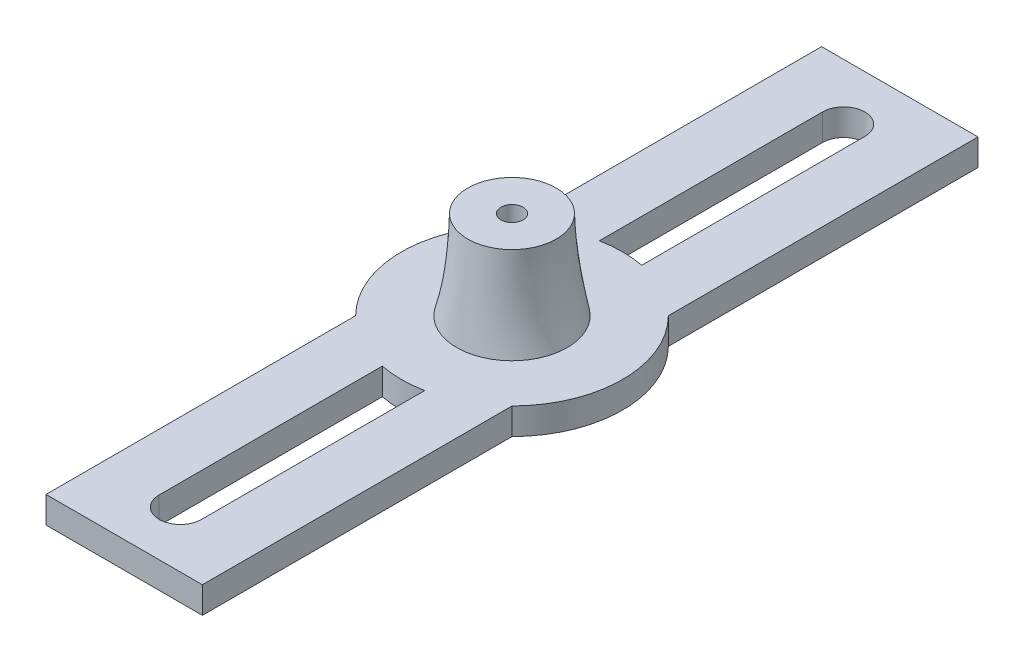
ISO-10303-21;
HEADER;
FILE_DESCRIPTION(('STEP AP214'),'2;1');
FILE_NAME('part.step','',(''),(''),'','','');
FILE_SCHEMA(('AUTOMOTIVE_DESIGN { 1 0 10303 214 1 1 1 1 }'));
ENDSEC;
DATA;
#1=APPLICATION_CONTEXT('core data for automotive mechanical design processes');
#2=APPLICATION_PROTOCOL_DEFINITION('international standard','automotive_design',2000,#1);
#3=PRODUCT_CONTEXT('',#1,'mechanical');
#4=PRODUCT('Part','Part','',(#3));
#5=PRODUCT_RELATED_PRODUCT_CATEGORY('part','',(#4));
#6=PRODUCT_DEFINITION_FORMATION('','',#4);
#7=PRODUCT_DEFINITION_CONTEXT('part definition',#1,'design');
#8=PRODUCT_DEFINITION('design','',#6,#7);
#9=PRODUCT_DEFINITION_SHAPE('','',#8);
#10=(LENGTH_UNIT() NAMED_UNIT(*) SI_UNIT(.MILLI.,.METRE.));
#11=(NAMED_UNIT(*) PLANE_ANGLE_UNIT() SI_UNIT($,.RADIAN.));
#12=(NAMED_UNIT(*) SI_UNIT($,.STERADIAN.) SOLID_ANGLE_UNIT());
#13=UNCERTAINTY_MEASURE_WITH_UNIT(LENGTH_MEASURE(1.E-05),#10,'distance_accuracy_value','');
#14=(GEOMETRIC_REPRESENTATION_CONTEXT(3) GLOBAL_UNCERTAINTY_ASSIGNED_CONTEXT((#13)) GLOBAL_UNIT_ASSIGNED_CONTEXT((#10,
#11,#12)) REPRESENTATION_CONTEXT('',''));
#15=CARTESIAN_POINT('',(0.,0.,0.));
#16=DIRECTION('',(0.,0.,1.));
#17=DIRECTION('',(1.,0.,0.));
#18=AXIS2_PLACEMENT_3D('',#15,#16,#17);
#19=CARTESIAN_POINT('',(0.,-3.,0.));
#20=DIRECTION('',(0.,1.,0.));
#21=DIRECTION('',(0.,0.,1.));
#22=AXIS2_PLACEMENT_3D('',#19,#20,#21);
#23=CYLINDRICAL_SURFACE('',#22,12.5);
#24=CARTESIAN_POINT('',(0.,0.,0.));
#25=DIRECTION('',(0.,1.,0.));
#26=DIRECTION('',(0.,0.,1.));
#27=AXIS2_PLACEMENT_3D('',#24,#25,#26);
#28=CIRCLE('',#27,12.5);
#29=CARTESIAN_POINT('',(2.39573347272426,0.,-12.2682705027102));
#30=VERTEX_POINT('',#29);
#31=CARTESIAN_POINT('',(-2.39573347272426,0.,-12.2682705027102));
#32=VERTEX_POINT('',#31);
#33=EDGE_CURVE('E393',#30,#32,#28,.T.);
#34=ORIENTED_EDGE('',*,*,#33,.F.);
#35=DIRECTION('',(0.,1.,0.));
#36=VECTOR('',#35,1.);
#37=CARTESIAN_POINT('',(2.39573347272426,-3.,-12.2682705027102));
#38=LINE('',#37,#36);
#39=CARTESIAN_POINT('',(2.39573347272426,-3.,-12.2682705027102));
#40=VERTEX_POINT('',#39);
#41=EDGE_CURVE('E270',#30,#40,#38,.F.);
#42=ORIENTED_EDGE('',*,*,#41,.T.);
#43=CARTESIAN_POINT('',(0.,-3.,0.));
#44=DIRECTION('',(0.,1.,0.));
#45=DIRECTION('',(0.,0.,1.));
#46=AXIS2_PLACEMENT_3D('',#43,#44,#45);
#47=CIRCLE('',#46,12.5);
#48=CARTESIAN_POINT('',(-2.39573347272426,-3.,-12.2682705027102));
#49=VERTEX_POINT('',#48);
#50=EDGE_CURVE('E114',#40,#49,#47,.T.);
#51=ORIENTED_EDGE('',*,*,#50,.T.);
#52=DIRECTION('',(0.,1.,0.));
#53=VECTOR('',#52,1.);
#54=CARTESIAN_POINT('',(-2.39573347272426,-3.,-12.2682705027102));
#55=LINE('',#54,#53);
#56=EDGE_CURVE('E261',#49,#32,#55,.T.);
#57=ORIENTED_EDGE('',*,*,#56,.T.);
#58=EDGE_LOOP('',(#34,#42,#51,#57));
#59=FACE_BOUND('',#58,.T.);
#60=ADVANCED_FACE('F103',(#59),#23,.T.);
#61=CARTESIAN_POINT('',(-2.39573347272426,-3.,12.2682705027102));
#62=VERTEX_POINT('',#61);
#63=CARTESIAN_POINT('',(2.39573347272426,-3.,12.2682705027102));
#64=VERTEX_POINT('',#63);
#65=EDGE_CURVE('E116',#62,#64,#47,.T.);
#66=ORIENTED_EDGE('',*,*,#65,.T.);
#67=DIRECTION('',(0.,1.,0.));
#68=VECTOR('',#67,1.);
#69=CARTESIAN_POINT('',(2.39573347272426,-3.,12.2682705027102));
#70=LINE('',#69,#68);
#71=CARTESIAN_POINT('',(2.39573347272426,0.,12.2682705027102));
#72=VERTEX_POINT('',#71);
#73=EDGE_CURVE('E267',#64,#72,#70,.T.);
#74=ORIENTED_EDGE('',*,*,#73,.T.);
#75=CARTESIAN_POINT('',(-2.39573347272426,0.,12.2682705027102));
#76=VERTEX_POINT('',#75);
#77=EDGE_CURVE('E350',#76,#72,#28,.T.);
#78=ORIENTED_EDGE('',*,*,#77,.F.);
#79=DIRECTION('',(0.,1.,0.));
#80=VECTOR('',#79,1.);
#81=CARTESIAN_POINT('',(-2.39573347272426,-3.,12.2682705027102));
#82=LINE('',#81,#80);
#83=EDGE_CURVE('E239',#76,#62,#82,.F.);
#84=ORIENTED_EDGE('',*,*,#83,.T.);
#85=EDGE_LOOP('',(#66,#74,#78,#84));
#86=FACE_BOUND('',#85,.T.);
#87=ADVANCED_FACE('F384',(#86),#23,.T.);
#88=DIRECTION('',(0.,1.,0.));
#89=VECTOR('',#88,1.);
#90=CARTESIAN_POINT('',(8.84061249383761,-3.,-8.83705667820471));
#91=LINE('',#90,#89);
#92=CARTESIAN_POINT('',(8.84061249383761,0.,-8.83705667820471));
#93=VERTEX_POINT('',#92);
#94=CARTESIAN_POINT('',(8.84061249383761,-3.,-8.83705667820471));
#95=VERTEX_POINT('',#94);
#96=EDGE_CURVE('E283',#93,#95,#91,.F.);
#97=ORIENTED_EDGE('',*,*,#96,.F.);
#98=CARTESIAN_POINT('',(8.84061249383761,0.,8.83705667820471));
#99=VERTEX_POINT('',#98);
#100=EDGE_CURVE('E356',#99,#93,#28,.T.);
#101=ORIENTED_EDGE('',*,*,#100,.F.);
#102=DIRECTION('',(0.,1.,0.));
#103=VECTOR('',#102,1.);
#104=CARTESIAN_POINT('',(8.84061249383761,-3.,8.83705667820471));
#105=LINE('',#104,#103);
#106=CARTESIAN_POINT('',(8.84061249383761,-3.,8.83705667820471));
#107=VERTEX_POINT('',#106);
#108=EDGE_CURVE('E280',#107,#99,#105,.T.);
#109=ORIENTED_EDGE('',*,*,#108,.F.);
#110=EDGE_CURVE('E13',#107,#95,#47,.T.);
#111=ORIENTED_EDGE('',*,*,#110,.T.);
#112=EDGE_LOOP('',(#97,#101,#109,#111));
#113=FACE_BOUND('',#112,.T.);
#114=ADVANCED_FACE('F370',(#113),#23,.T.);
#115=CARTESIAN_POINT('',(0.,0.,0.));
#116=DIRECTION('',(0.,1.,0.));
#117=DIRECTION('',(0.,0.,1.));
#118=AXIS2_PLACEMENT_3D('',#115,#116,#117);
#119=PLANE('',#118);
#120=CARTESIAN_POINT('',(-8.84061249383761,0.,-8.83705667820471));
#121=VERTEX_POINT('',#120);
#122=CARTESIAN_POINT('',(-8.84061249383761,0.,8.83705667820471));
#123=VERTEX_POINT('',#122);
#124=EDGE_CURVE('E359',#121,#123,#28,.T.);
#125=ORIENTED_EDGE('',*,*,#124,.T.);
#126=DIRECTION('',(0.,0.,-1.));
#127=VECTOR('',#126,1.);
#128=CARTESIAN_POINT('',(-8.84061249383761,0.,43.8412467482134));
#129=LINE('',#128,#127);
#130=CARTESIAN_POINT('',(-8.84061249383761,0.,43.8412467482134));
#131=VERTEX_POINT('',#130);
#132=EDGE_CURVE('E407',#131,#123,#129,.T.);
#133=ORIENTED_EDGE('',*,*,#132,.F.);
#134=DIRECTION('',(-1.,0.,0.));
#135=VECTOR('',#134,1.);
#136=CARTESIAN_POINT('',(-8.84061249383761,0.,43.8412467482134));
#137=LINE('',#136,#135);
#138=CARTESIAN_POINT('',(8.84061249383761,0.,43.8412467482134));
#139=VERTEX_POINT('',#138);
#140=EDGE_CURVE('E477',#139,#131,#137,.T.);
#141=ORIENTED_EDGE('',*,*,#140,.F.);
#142=DIRECTION('',(0.,0.,1.));
#143=VECTOR('',#142,1.);
#144=CARTESIAN_POINT('',(8.84061249383761,0.,43.8412467482134));
#145=LINE('',#144,#143);
#146=EDGE_CURVE('E429',#99,#139,#145,.T.);
#147=ORIENTED_EDGE('',*,*,#146,.F.);
#148=ORIENTED_EDGE('',*,*,#100,.T.);
#149=CARTESIAN_POINT('',(8.84061249383761,0.,-43.8412467482134));
#150=VERTEX_POINT('',#149);
#151=EDGE_CURVE('E475',#150,#93,#145,.T.);
#152=ORIENTED_EDGE('',*,*,#151,.F.);
#153=DIRECTION('',(1.,0.,0.));
#154=VECTOR('',#153,1.);
#155=CARTESIAN_POINT('',(-8.84061249383761,0.,-43.8412467482134));
#156=LINE('',#155,#154);
#157=CARTESIAN_POINT('',(-8.84061249383761,0.,-43.8412467482134));
#158=VERTEX_POINT('',#157);
#159=EDGE_CURVE('E445',#158,#150,#156,.T.);
#160=ORIENTED_EDGE('',*,*,#159,.F.);
#161=EDGE_CURVE('E410',#121,#158,#129,.T.);
#162=ORIENTED_EDGE('',*,*,#161,.F.);
#163=EDGE_LOOP('',(#125,#133,#141,#147,#148,#152,#160,#162));
#164=FACE_BOUND('',#163,.T.);
#165=CARTESIAN_POINT('',(0.,0.,0.));
#166=DIRECTION('',(0.,1.,0.));
#167=DIRECTION('',(0.,0.,1.));
#168=AXIS2_PLACEMENT_3D('',#165,#166,#167);
#169=CIRCLE('',#168,6.25);
#170=CARTESIAN_POINT('',(-6.25,0.,0.));
#171=VERTEX_POINT('',#170);
#172=EDGE_CURVE('E107',#171,#171,#169,.T.);
#173=ORIENTED_EDGE('',*,*,#172,.F.);
#174=EDGE_LOOP('',(#173));
#175=FACE_BOUND('',#174,.T.);
#176=DIRECTION('',(0.,0.,1.));
#177=VECTOR('',#176,1.);
#178=CARTESIAN_POINT('',(2.39573347272426,0.,37.5));
#179=LINE('',#178,#177);
#180=CARTESIAN_POINT('',(2.39573347272426,0.,-37.5));
#181=VERTEX_POINT('',#180);
#182=EDGE_CURVE('E233',#181,#30,#179,.T.);
#183=ORIENTED_EDGE('',*,*,#182,.T.);
#184=ORIENTED_EDGE('',*,*,#33,.T.);
#185=DIRECTION('',(0.,0.,-1.));
#186=VECTOR('',#185,1.);
#187=CARTESIAN_POINT('',(-2.39573347272426,0.,37.5));
#188=LINE('',#187,#186);
#189=CARTESIAN_POINT('',(-2.39573347272426,0.,-37.5));
#190=VERTEX_POINT('',#189);
#191=EDGE_CURVE('E123',#32,#190,#188,.T.);
#192=ORIENTED_EDGE('',*,*,#191,.T.);
#193=CARTESIAN_POINT('',(0.,0.,-37.5));
#194=DIRECTION('',(0.,-1.,0.));
#195=DIRECTION('',(0.,0.,-1.));
#196=AXIS2_PLACEMENT_3D('',#193,#194,#195);
#197=CIRCLE('',#196,2.39573347272426);
#198=EDGE_CURVE('E244',#190,#181,#197,.T.);
#199=ORIENTED_EDGE('',*,*,#198,.T.);
#200=EDGE_LOOP('',(#183,#184,#192,#199));
#201=FACE_BOUND('',#200,.T.);
#202=ORIENTED_EDGE('',*,*,#77,.T.);
#203=CARTESIAN_POINT('',(2.39573347272426,0.,37.5));
#204=VERTEX_POINT('',#203);
#205=EDGE_CURVE('E131',#72,#204,#179,.T.);
#206=ORIENTED_EDGE('',*,*,#205,.T.);
#207=CARTESIAN_POINT('',(0.,0.,37.5));
#208=DIRECTION('',(0.,-1.,0.));
#209=DIRECTION('',(0.,0.,-1.));
#210=AXIS2_PLACEMENT_3D('',#207,#208,#209);
#211=CIRCLE('',#210,2.39573347272426);
#212=CARTESIAN_POINT('',(-2.39573347272426,0.,37.5));
#213=VERTEX_POINT('',#212);
#214=EDGE_CURVE('E226',#204,#213,#211,.T.);
#215=ORIENTED_EDGE('',*,*,#214,.T.);
#216=EDGE_CURVE('E236',#213,#76,#188,.T.);
#217=ORIENTED_EDGE('',*,*,#216,.T.);
#218=EDGE_LOOP('',(#202,#206,#215,#217));
#219=FACE_BOUND('',#218,.T.);
#220=ADVANCED_FACE('F246',(#164,#175,#201,#219),#119,.T.);
#221=DIRECTION('',(0.,1.,0.));
#222=VECTOR('',#221,1.);
#223=CARTESIAN_POINT('',(-8.84061249383761,-3.,8.83705667820471));
#224=LINE('',#223,#222);
#225=CARTESIAN_POINT('',(-8.84061249383761,-3.,8.83705667820471));
#226=VERTEX_POINT('',#225);
#227=EDGE_CURVE('E277',#123,#226,#224,.F.);
#228=ORIENTED_EDGE('',*,*,#227,.F.);
#229=ORIENTED_EDGE('',*,*,#124,.F.);
#230=DIRECTION('',(0.,1.,0.));
#231=VECTOR('',#230,1.);
#232=CARTESIAN_POINT('',(-8.84061249383761,-3.,-8.83705667820471));
#233=LINE('',#232,#231);
#234=CARTESIAN_POINT('',(-8.84061249383761,-3.,-8.83705667820471));
#235=VERTEX_POINT('',#234);
#236=EDGE_CURVE('E274',#235,#121,#233,.T.);
#237=ORIENTED_EDGE('',*,*,#236,.F.);
#238=EDGE_CURVE('E355',#235,#226,#47,.T.);
#239=ORIENTED_EDGE('',*,*,#238,.T.);
#240=EDGE_LOOP('',(#228,#229,#237,#239));
#241=FACE_BOUND('',#240,.T.);
#242=ADVANCED_FACE('F105',(#241),#23,.T.);
#243=CARTESIAN_POINT('',(0.,-3.,0.));
#244=DIRECTION('',(0.,1.,0.));
#245=DIRECTION('',(0.,0.,1.));
#246=AXIS2_PLACEMENT_3D('',#243,#244,#245);
#247=PLANE('',#246);
#248=ORIENTED_EDGE('',*,*,#238,.F.);
#249=DIRECTION('',(0.,0.,-1.));
#250=VECTOR('',#249,1.);
#251=CARTESIAN_POINT('',(-8.84061249383761,-3.,43.8412467482134));
#252=LINE('',#251,#250);
#253=CARTESIAN_POINT('',(-8.84061249383761,-3.,-43.8412467482134));
#254=VERTEX_POINT('',#253);
#255=EDGE_CURVE('E424',#235,#254,#252,.T.);
#256=ORIENTED_EDGE('',*,*,#255,.T.);
#257=DIRECTION('',(1.,0.,0.));
#258=VECTOR('',#257,1.);
#259=CARTESIAN_POINT('',(-8.84061249383761,-3.,-43.8412467482134));
#260=LINE('',#259,#258);
#261=CARTESIAN_POINT('',(8.84061249383761,-3.,-43.8412467482134));
#262=VERTEX_POINT('',#261);
#263=EDGE_CURVE('E423',#254,#262,#260,.T.);
#264=ORIENTED_EDGE('',*,*,#263,.T.);
#265=DIRECTION('',(0.,0.,1.));
#266=VECTOR('',#265,1.);
#267=CARTESIAN_POINT('',(8.84061249383761,-3.,43.8412467482134));
#268=LINE('',#267,#266);
#269=EDGE_CURVE('E456',#262,#95,#268,.T.);
#270=ORIENTED_EDGE('',*,*,#269,.T.);
#271=ORIENTED_EDGE('',*,*,#110,.F.);
#272=CARTESIAN_POINT('',(8.84061249383761,-3.,43.8412467482134));
#273=VERTEX_POINT('',#272);
#274=EDGE_CURVE('E459',#107,#273,#268,.T.);
#275=ORIENTED_EDGE('',*,*,#274,.T.);
#276=DIRECTION('',(-1.,0.,0.));
#277=VECTOR('',#276,1.);
#278=CARTESIAN_POINT('',(-8.84061249383761,-3.,43.8412467482134));
#279=LINE('',#278,#277);
#280=CARTESIAN_POINT('',(-8.84061249383761,-3.,43.8412467482134));
#281=VERTEX_POINT('',#280);
#282=EDGE_CURVE('E421',#273,#281,#279,.T.);
#283=ORIENTED_EDGE('',*,*,#282,.T.);
#284=EDGE_CURVE('E418',#281,#226,#252,.T.);
#285=ORIENTED_EDGE('',*,*,#284,.T.);
#286=EDGE_LOOP('',(#248,#256,#264,#270,#271,#275,#283,#285));
#287=FACE_BOUND('',#286,.T.);
#288=ORIENTED_EDGE('',*,*,#65,.F.);
#289=DIRECTION('',(0.,0.,-1.));
#290=VECTOR('',#289,1.);
#291=CARTESIAN_POINT('',(-2.39573347272426,-3.,37.5));
#292=LINE('',#291,#290);
#293=CARTESIAN_POINT('',(-2.39573347272426,-3.,37.5));
#294=VERTEX_POINT('',#293);
#295=EDGE_CURVE('E624',#294,#62,#292,.T.);
#296=ORIENTED_EDGE('',*,*,#295,.F.);
#297=CARTESIAN_POINT('',(0.,-3.,37.5));
#298=DIRECTION('',(0.,-1.,0.));
#299=DIRECTION('',(0.,0.,-1.));
#300=AXIS2_PLACEMENT_3D('',#297,#298,#299);
#301=CIRCLE('',#300,2.39573347272426);
#302=CARTESIAN_POINT('',(2.39573347272426,-3.,37.5));
#303=VERTEX_POINT('',#302);
#304=EDGE_CURVE('E228',#303,#294,#301,.T.);
#305=ORIENTED_EDGE('',*,*,#304,.F.);
#306=DIRECTION('',(0.,0.,1.));
#307=VECTOR('',#306,1.);
#308=CARTESIAN_POINT('',(2.39573347272426,-3.,37.5));
#309=LINE('',#308,#307);
#310=EDGE_CURVE('E253',#64,#303,#309,.T.);
#311=ORIENTED_EDGE('',*,*,#310,.F.);
#312=EDGE_LOOP('',(#288,#296,#305,#311));
#313=FACE_BOUND('',#312,.T.);
#314=CARTESIAN_POINT('',(-2.39573347272426,-3.,-37.5));
#315=VERTEX_POINT('',#314);
#316=EDGE_CURVE('E628',#49,#315,#292,.T.);
#317=ORIENTED_EDGE('',*,*,#316,.F.);
#318=ORIENTED_EDGE('',*,*,#50,.F.);
#319=CARTESIAN_POINT('',(2.39573347272426,-3.,-37.5));
#320=VERTEX_POINT('',#319);
#321=EDGE_CURVE('E248',#320,#40,#309,.T.);
#322=ORIENTED_EDGE('',*,*,#321,.F.);
#323=CARTESIAN_POINT('',(0.,-3.,-37.5));
#324=DIRECTION('',(0.,-1.,0.));
#325=DIRECTION('',(0.,0.,-1.));
#326=AXIS2_PLACEMENT_3D('',#323,#324,#325);
#327=CIRCLE('',#326,2.39573347272426);
#328=EDGE_CURVE('E621',#315,#320,#327,.T.);
#329=ORIENTED_EDGE('',*,*,#328,.F.);
#330=EDGE_LOOP('',(#317,#318,#322,#329));
#331=FACE_BOUND('',#330,.T.);
#332=ADVANCED_FACE('F372',(#287,#313,#331),#247,.F.);
#333=CARTESIAN_POINT('',(0.,10.,0.));
#334=DIRECTION('',(0.,1.,0.));
#335=DIRECTION('',(0.,0.,1.));
#336=AXIS2_PLACEMENT_3D('',#333,#334,#335);
#337=PLANE('',#336);
#338=CARTESIAN_POINT('',(0.,10.,0.));
#339=DIRECTION('',(0.,1.,0.));
#340=DIRECTION('',(0.,0.,1.));
#341=AXIS2_PLACEMENT_3D('',#338,#339,#340);
#342=CIRCLE('',#341,1.25);
#343=CARTESIAN_POINT('',(0.,10.,1.25));
#344=VERTEX_POINT('',#343);
#345=EDGE_CURVE('E286',#344,#344,#342,.T.);
#346=ORIENTED_EDGE('',*,*,#345,.F.);
#347=EDGE_LOOP('',(#346));
#348=FACE_BOUND('',#347,.T.);
#349=CARTESIAN_POINT('',(0.,10.,0.));
#350=DIRECTION('',(0.,1.,0.));
#351=DIRECTION('',(0.,0.,1.));
#352=AXIS2_PLACEMENT_3D('',#349,#350,#351);
#353=CIRCLE('',#352,5.);
#354=CARTESIAN_POINT('',(-5.,10.,0.));
#355=VERTEX_POINT('',#354);
#356=EDGE_CURVE('E339',#355,#355,#353,.T.);
#357=ORIENTED_EDGE('',*,*,#356,.T.);
#358=EDGE_LOOP('',(#357));
#359=FACE_BOUND('',#358,.T.);
#360=ADVANCED_FACE('F317',(#348,#359),#337,.T.);
#361=CARTESIAN_POINT('',(-6.25,0.,0.));
#362=CARTESIAN_POINT('',(-5.14774690989518,3.22293453320632,0.));
#363=CARTESIAN_POINT('',(-4.73108024322851,6.55626786653966,0.));
#364=CARTESIAN_POINT('',(-5.,10.,0.));
#365=CARTESIAN_POINT('',(-6.25,0.,0.818123080343785));
#366=CARTESIAN_POINT('',(-5.14774690989518,3.22293453320632,0.7635815416542));
#367=CARTESIAN_POINT('',(-4.73108024322851,6.55626786653966,0.709040002964614));
#368=CARTESIAN_POINT('',(-5.,10.,0.654498464275028));
#369=CARTESIAN_POINT('',(-5.92497378673173,0.,2.45402346615535));
#370=CARTESIAN_POINT('',(-4.88723629418098,3.22293453320633,2.29042438513216));
#371=CARTESIAN_POINT('',(-4.49223607360351,6.55626786653966,2.12682530410897));
#372=CARTESIAN_POINT('',(-4.73997312499931,10.,1.96322622308577));
#373=CARTESIAN_POINT('',(-4.53455818285894,0.,4.53463458689664));
#374=CARTESIAN_POINT('',(-3.75020222330389,3.22293453320632,4.23232708701451));
#375=CARTESIAN_POINT('',(-3.44789921772878,6.55626786653965,3.93001958713238));
#376=CARTESIAN_POINT('',(-3.62764916613363,9.99999999999999,3.62771208725025));
#377=CARTESIAN_POINT('',(-2.45416094630535,0.,5.92478844630201));
#378=CARTESIAN_POINT('',(-2.03346259916829,3.22293453320633,5.52979087480085));
#379=CARTESIAN_POINT('',(-1.86985916082054,6.55626786653966,5.13479330329969));
#380=CARTESIAN_POINT('',(-1.9633506312621,10.,4.73979573179852));
#381=CARTESIAN_POINT('',(0.,0.,6.41290784982893));
#382=CARTESIAN_POINT('',(0.,3.22293453320632,5.9853938750241));
#383=CARTESIAN_POINT('',(0.,6.55626786653964,5.55787990021926));
#384=CARTESIAN_POINT('',(0.,9.99999999999998,5.13036592541442));
#385=CARTESIAN_POINT('',(2.45416094630536,0.,5.92478844630201));
#386=CARTESIAN_POINT('',(2.0334625991683,3.22293453320634,5.52979087480085));
#387=CARTESIAN_POINT('',(1.86985916082054,6.55626786653968,5.13479330329969));
#388=CARTESIAN_POINT('',(1.96335063126209,10.,4.73979573179853));
#389=CARTESIAN_POINT('',(4.53455818285894,0.,4.53463458689664));
#390=CARTESIAN_POINT('',(3.75020222330388,3.22293453320632,4.23232708701451));
#391=CARTESIAN_POINT('',(3.44789921772878,6.55626786653964,3.93001958713238));
#392=CARTESIAN_POINT('',(3.62764916613364,9.99999999999998,3.62771208725025));
#393=CARTESIAN_POINT('',(5.92497378673173,0.,2.45402346615534));
#394=CARTESIAN_POINT('',(4.88723629418098,3.22293453320633,2.29042438513215));
#395=CARTESIAN_POINT('',(4.49223607360351,6.55626786653967,2.12682530410896));
#396=CARTESIAN_POINT('',(4.7399731249993,10.,1.96322622308578));
#397=CARTESIAN_POINT('',(6.25,0.,0.818123080343786));
#398=CARTESIAN_POINT('',(5.14774690989518,3.22293453320632,0.7635815416542));
#399=CARTESIAN_POINT('',(4.73108024322851,6.55626786653966,0.709040002964614));
#400=CARTESIAN_POINT('',(5.,10.,0.654498464275029));
#401=CARTESIAN_POINT('',(6.25,0.,-0.818123080343786));
#402=CARTESIAN_POINT('',(5.14774690989518,3.22293453320632,-0.7635815416542));
#403=CARTESIAN_POINT('',(4.73108024322851,6.55626786653966,-0.709040002964614));
#404=CARTESIAN_POINT('',(5.,10.,-0.654498464275028));
#405=CARTESIAN_POINT('',(5.92497378673174,0.,-2.45402346615535));
#406=CARTESIAN_POINT('',(4.88723629418099,3.22293453320632,-2.29042438513216));
#407=CARTESIAN_POINT('',(4.49223607360351,6.55626786653965,-2.12682530410897));
#408=CARTESIAN_POINT('',(4.73997312499931,9.99999999999999,-1.96322622308578));
#409=CARTESIAN_POINT('',(4.53455818285893,0.,-4.53463458689663));
#410=CARTESIAN_POINT('',(3.75020222330388,3.22293453320633,-4.2323270870145));
#411=CARTESIAN_POINT('',(3.44789921772878,6.55626786653966,-3.93001958713237));
#412=CARTESIAN_POINT('',(3.62764916613363,10.,-3.62771208725025));
#413=CARTESIAN_POINT('',(2.45416094630536,0.,-5.92478844630203));
#414=CARTESIAN_POINT('',(2.0334625991683,3.22293453320632,-5.52979087480086));
#415=CARTESIAN_POINT('',(1.86985916082055,6.55626786653966,-5.1347933032997));
#416=CARTESIAN_POINT('',(1.96335063126211,10.,-4.73979573179853));
#417=CARTESIAN_POINT('',(0.,0.,-6.41290784982892));
#418=CARTESIAN_POINT('',(0.,3.22293453320632,-5.98539387502408));
#419=CARTESIAN_POINT('',(0.,6.55626786653965,-5.55787990021925));
#420=CARTESIAN_POINT('',(0.,9.99999999999999,-5.13036592541442));
#421=CARTESIAN_POINT('',(-2.45416094630536,0.,-5.92478844630203));
#422=CARTESIAN_POINT('',(-2.03346259916829,3.22293453320633,-5.52979087480086));
#423=CARTESIAN_POINT('',(-1.86985916082054,6.55626786653968,-5.13479330329969));
#424=CARTESIAN_POINT('',(-1.9633506312621,10.,-4.73979573179852));
#425=CARTESIAN_POINT('',(-4.53455818285894,0.,-4.53463458689662));
#426=CARTESIAN_POINT('',(-3.75020222330389,3.22293453320632,-4.2323270870145));
#427=CARTESIAN_POINT('',(-3.44789921772879,6.55626786653965,-3.93001958713238));
#428=CARTESIAN_POINT('',(-3.62764916613364,9.99999999999998,-3.62771208725026));
#429=CARTESIAN_POINT('',(-5.92497378673173,0.,-2.45402346615535));
#430=CARTESIAN_POINT('',(-4.88723629418098,3.22293453320633,-2.29042438513216));
#431=CARTESIAN_POINT('',(-4.4922360736035,6.55626786653966,-2.12682530410897));
#432=CARTESIAN_POINT('',(-4.7399731249993,10.,-1.96322622308578));
#433=CARTESIAN_POINT('',(-6.25,0.,-0.818123080343787));
#434=CARTESIAN_POINT('',(-5.14774690989518,3.22293453320632,-0.7635815416542));
#435=CARTESIAN_POINT('',(-4.73108024322851,6.55626786653966,-0.709040002964614));
#436=CARTESIAN_POINT('',(-5.,10.,-0.65449846427503));
#437=CARTESIAN_POINT('',(-6.25,0.,0.));
#438=CARTESIAN_POINT('',(-5.14774690989518,3.22293453320632,0.));
#439=CARTESIAN_POINT('',(-4.73108024322851,6.55626786653966,0.));
#440=CARTESIAN_POINT('',(-5.,10.,0.));
#441=B_SPLINE_SURFACE_WITH_KNOTS('',3,3,((#361,#362,#363,#364),(#365,#366,#367,#368),(#369,#370,
#371,#372),(#373,#374,#375,#376),(#377,#378,#379,#380),(#381,#382,#383,#384),(#385,#386,#387,
#388),(#389,#390,#391,#392),(#393,#394,#395,#396),(#397,#398,#399,#400),(#401,#402,#403,#404),
(#405,#406,#407,#408),(#409,#410,#411,#412),(#413,#414,#415,#416),(#417,#418,#419,#420),(#421,
#422,#423,#424),(#425,#426,#427,#428),(#429,#430,#431,#432),(#433,#434,#435,#436),(#437,#438,
#439,#440)),.UNSPECIFIED.,.T.,.F.,.F.,(4,1,1,1,1,1,1,1,2,1,1,1,1,1,1,1,4),(4,4),(0.,0.0625,
0.125,0.1875,0.25,0.3125,0.375,0.4375,0.5,0.5625,0.625,0.6875,0.75,0.8125,0.875,0.9375,1.),(0.,
1.),.UNSPECIFIED.);
#442=CARTESIAN_POINT('',(-6.25,0.,0.));
#443=CARTESIAN_POINT('',(-6.24139095188316,0.02517243717846,0.));
#444=CARTESIAN_POINT('',(-6.23282140959878,0.0503583859444963,0.));
#445=CARTESIAN_POINT('',(-6.21576605671566,0.10074377401458,0.));
#446=CARTESIAN_POINT('',(-6.20728020423556,0.125943199141917,0.));
#447=CARTESIAN_POINT('',(-6.19039223077537,0.176355540002636,0.));
#448=CARTESIAN_POINT('',(-6.18199006860971,0.201568441938886,0.));
#449=CARTESIAN_POINT('',(-6.16526947494496,0.252007735917173,0.));
#450=CARTESIAN_POINT('',(-6.15695100296197,0.277234114538765,0.));
#451=CARTESIAN_POINT('',(-6.14039778899558,0.327700361543681,0.));
#452=CARTESIAN_POINT('',(-6.13216300723532,0.352940216879905,0.));
#453=CARTESIAN_POINT('',(-6.1157771729959,0.403433416932351,0.));
#454=CARTESIAN_POINT('',(-6.10762608145235,0.428686748971506,0.));
#455=CARTESIAN_POINT('',(-6.09140762693483,0.479206902062395,0.));
#456=CARTESIAN_POINT('',(-6.08334022561427,0.504473710803689,0.));
#457=CARTESIAN_POINT('',(-6.06728915082258,0.555020816931922,0.));
#458=CARTESIAN_POINT('',(-6.05930543972794,0.58030110237158,0.));
#459=CARTESIAN_POINT('',(-6.04342174466357,0.630875161533879,0.));
#460=CARTESIAN_POINT('',(-6.03552172379862,0.65616892366886,0.));
#461=CARTESIAN_POINT('',(-6.01980540846368,0.706769935862487,0.));
#462=CARTESIAN_POINT('',(-6.01198907783191,0.732077174689491,0.));
#463=CARTESIAN_POINT('',(-5.99644014222833,0.782705139911526,0.));
#464=CARTESIAN_POINT('',(-5.98870750183325,0.808025855427259,0.));
#465=CARTESIAN_POINT('',(-5.97332594596297,0.85868077367479,0.));
#466=CARTESIAN_POINT('',(-5.96567699580801,0.884014965875897,0.));
#467=CARTESIAN_POINT('',(-5.95046281967294,0.93469683714597,0.));
#468=CARTESIAN_POINT('',(-5.94289755976149,0.960044506029049,0.));
#469=CARTESIAN_POINT('',(-5.92785076336353,1.01075333031868,0.));
#470=CARTESIAN_POINT('',(-5.92036919369895,1.03611447588029,0.));
#471=CARTESIAN_POINT('',(-5.90548977703997,1.08685025318647,0.));
#472=CARTESIAN_POINT('',(-5.89809189762555,1.1122248754231,0.));
#473=CARTESIAN_POINT('',(-5.88337986070737,1.16298760574279,0.));
#474=CARTESIAN_POINT('',(-5.87606567154636,1.18837570465091,0.));
#475=CARTESIAN_POINT('',(-5.86152101437081,1.23916538798104,0.));
#476=CARTESIAN_POINT('',(-5.85429051546641,1.26456696355706,0.));
#477=CARTESIAN_POINT('',(-5.83991323803528,1.31538359989452,0.));
#478=CARTESIAN_POINT('',(-5.83276642939062,1.34079865213481,0.));
#479=CARTESIAN_POINT('',(-5.81855653170568,1.39164224147648,0.));
#480=CARTESIAN_POINT('',(-5.81149341332385,1.41707077037736,0.));
#481=CARTESIAN_POINT('',(-5.79745089538685,1.46794131272008,0.));
#482=CARTESIAN_POINT('',(-5.79047146727088,1.49338331827784,0.));
#483=CARTESIAN_POINT('',(-5.77659632908352,1.54428081361843,0.));
#484=CARTESIAN_POINT('',(-5.7697005912364,1.5697362958293,0.));
#485=CARTESIAN_POINT('',(-5.75599283280038,1.62066074416455,0.));
#486=CARTESIAN_POINT('',(-5.74918078522502,1.64612970302472,0.));
#487=CARTESIAN_POINT('',(-5.73564040654199,1.69708110435139,0.));
#488=CARTESIAN_POINT('',(-5.72891204924127,1.72256353985703,0.));
#489=CARTESIAN_POINT('',(-5.71553905031286,1.77354189417185,0.));
#490=CARTESIAN_POINT('',(-5.70889438328958,1.79903780631906,0.));
#491=CARTESIAN_POINT('',(-5.6956887641174,1.85004311361876,0.));
#492=CARTESIAN_POINT('',(-5.68912778737431,1.87555250240362,0.));
#493=CARTESIAN_POINT('',(-5.67608954795994,1.92658476268487,0.));
#494=CARTESIAN_POINT('',(-5.66961226149973,1.95210762810341,0.));
#495=CARTESIAN_POINT('',(-5.65674140184471,2.00316684136289,0.));
#496=CARTESIAN_POINT('',(-5.65034780567002,2.0287031834111,0.));
#497=CARTESIAN_POINT('',(-5.63764432577586,2.07978934964544,0.));
#498=CARTESIAN_POINT('',(-5.63133441988926,2.10533916831929,0.));
#499=CARTESIAN_POINT('',(-5.61879831975746,2.1564522875251,0.));
#500=CARTESIAN_POINT('',(-5.61257210416145,2.1820155828205,0.));
#501=CARTESIAN_POINT('',(-5.60020338379347,2.23315565499438,0.));
#502=CARTESIAN_POINT('',(-5.59406085849049,2.25873242690723,0.));
#503=CARTESIAN_POINT('',(-5.58185951788776,2.30989945204575,0.));
#504=CARTESIAN_POINT('',(-5.57580068288021,2.33548970057188,0.));
#505=CARTESIAN_POINT('',(-5.56376672204411,2.3866836786716,0.));
#506=CARTESIAN_POINT('',(-5.5577915773343,2.41228740380683,0.));
#507=CARTESIAN_POINT('',(-5.54592499626621,2.46350833486427,0.));
#508=CARTESIAN_POINT('',(-5.54003354185641,2.48912553660439,0.));
#509=CARTESIAN_POINT('',(-5.52833434055765,2.54037342061605,0.));
#510=CARTESIAN_POINT('',(-5.52252657645005,2.56600409895681,0.));
#511=CARTESIAN_POINT('',(-5.51099475492193,2.61727893591919,0.));
#512=CARTESIAN_POINT('',(-5.50527068111865,2.6429230908563,0.));
#513=CARTESIAN_POINT('',(-5.49390623936244,2.69422488076588,0.));
#514=CARTESIAN_POINT('',(-5.48826585586554,2.71988251229502,0.));
#515=CARTESIAN_POINT('',(-5.47706879388248,2.77121125514824,0.));
#516=CARTESIAN_POINT('',(-5.47151210069397,2.79688236326508,0.));
#517=CARTESIAN_POINT('',(-5.46048241848525,2.84823805905837,0.));
#518=CARTESIAN_POINT('',(-5.45500941560705,2.87392264375853,0.));
#519=CARTESIAN_POINT('',(-5.44414711317386,2.92530529248832,0.));
#520=CARTESIAN_POINT('',(-5.43875780060782,2.9510033537674,0.));
#521=CARTESIAN_POINT('',(-5.42806287795129,3.00241295543008,0.));
#522=CARTESIAN_POINT('',(-5.42275725569922,3.02812449328366,0.));
#523=CARTESIAN_POINT('',(-5.41222971282044,3.07956104787562,0.));
#524=CARTESIAN_POINT('',(-5.40700778088406,3.10528606229924,0.));
#525=CARTESIAN_POINT('',(-5.39664761778412,3.15674956981684,0.));
#526=CARTESIAN_POINT('',(-5.39150937616508,3.18248806080602,0.));
#527=CARTESIAN_POINT('',(-5.38131659284502,3.23397852124563,0.));
#528=CARTESIAN_POINT('',(-5.37626204154491,3.25973048879587,0.));
#529=CARTESIAN_POINT('',(-5.36623663800571,3.31124790215382,0.));
#530=CARTESIAN_POINT('',(-5.36126577702604,3.33701334626059,0.));
#531=CARTESIAN_POINT('',(-5.35140775326868,3.38855771253322,0.));
#532=CARTESIAN_POINT('',(-5.34652058261092,3.41433663319197,0.));
#533=CARTESIAN_POINT('',(-5.33682993863632,3.46590795237558,0.));
#534=CARTESIAN_POINT('',(-5.33202645830182,3.49170034958175,0.));
#535=CARTESIAN_POINT('',(-5.32250319411089,3.54329862167265,0.));
#536=CARTESIAN_POINT('',(-5.31778340410097,3.56910449542165,0.));
#537=CARTESIAN_POINT('',(-5.30842751969457,3.62072972041613,0.));
#538=CARTESIAN_POINT('',(-5.30379142001045,3.64654907070334,0.));
#539=CARTESIAN_POINT('',(-5.2946029153894,3.69820124859769,0.));
#540=CARTESIAN_POINT('',(-5.29005050603225,3.72403407541849,0.));
#541=CARTESIAN_POINT('',(-5.28102938119735,3.77571320620897,0.));
#542=CARTESIAN_POINT('',(-5.27656066216825,3.80155950955872,0.));
#543=CARTESIAN_POINT('',(-5.26770691712025,3.85326559324159,0.));
#544=CARTESIAN_POINT('',(-5.26332188842023,3.87912537311563,0.));
#545=CARTESIAN_POINT('',(-5.25463552315984,3.93085840968716,0.));
#546=CARTESIAN_POINT('',(-5.25033418478985,3.9567316660808,0.));
#547=CARTESIAN_POINT('',(-5.24181519931776,4.00849165553723,0.));
#548=CARTESIAN_POINT('',(-5.23759755127866,4.0343783884458,0.));
#549=CARTESIAN_POINT('',(-5.22924594559551,4.08616533078337,0.));
#550=CARTESIAN_POINT('',(-5.22511198788812,4.11206554020215,0.));
#551=CARTESIAN_POINT('',(-5.21692776199452,4.16387943541709,0.));
#552=CARTESIAN_POINT('',(-5.21287749461954,4.18979312134138,0.));
#553=CARTESIAN_POINT('',(-5.20486064851607,4.24163396942992,0.));
#554=CARTESIAN_POINT('',(-5.20089407147417,4.26756113185499,0.));
#555=CARTESIAN_POINT('',(-5.19304460516136,4.31942893281336,0.));
#556=CARTESIAN_POINT('',(-5.18916171845312,4.34536957173448,0.));
#557=CARTESIAN_POINT('',(-5.18147963193146,4.39726432555888,0.));
#558=CARTESIAN_POINT('',(-5.17768043555739,4.4232184409713,0.));
#559=CARTESIAN_POINT('',(-5.17016572882736,4.47514014765797,0.));
#560=CARTESIAN_POINT('',(-5.16645022278788,4.50110773955694,0.));
#561=CARTESIAN_POINT('',(-5.1591028958499,4.55305639910208,0.));
#562=CARTESIAN_POINT('',(-5.15547108014538,4.57903746748285,0.));
#563=CARTESIAN_POINT('',(-5.14829113299983,4.63101307988266,0.));
#564=CARTESIAN_POINT('',(-5.14474300763055,4.65700762474047,0.));
#565=CARTESIAN_POINT('',(-5.1377304402778,4.70901018999117,0.));
#566=CARTESIAN_POINT('',(-5.13426600524398,4.73501821132124,0.));
#567=CARTESIAN_POINT('',(-5.12742081768433,4.78704772941905,0.));
#568=CARTESIAN_POINT('',(-5.1240400729861,4.81306922721661,0.));
#569=CARTESIAN_POINT('',(-5.11736226521983,4.86512569815773,0.));
#570=CARTESIAN_POINT('',(-5.11406521085726,4.89116067241802,0.));
#571=CARTESIAN_POINT('',(-5.10755478288461,4.94324409619865,0.));
#572=CARTESIAN_POINT('',(-5.10434141885769,4.96929254691689,0.));
#573=CARTESIAN_POINT('',(-5.09799837067886,5.02140292353325,0.));
#574=CARTESIAN_POINT('',(-5.09486869698752,5.04746485070467,0.));
#575=CARTESIAN_POINT('',(-5.08869302860268,5.09960218015298,0.));
#576=CARTESIAN_POINT('',(-5.08564704524675,5.1256775837728,0.));
#577=CARTESIAN_POINT('',(-5.07963875665603,5.17784186604926,0.));
#578=CARTESIAN_POINT('',(-5.07667646363528,5.20393074611272,0.));
#579=CARTESIAN_POINT('',(-5.07083555483877,5.25612198121356,0.));
#580=CARTESIAN_POINT('',(-5.06795695215292,5.28222433771588,0.));
#581=CARTESIAN_POINT('',(-5.06228342315067,5.33444252563733,0.));
#582=CARTESIAN_POINT('',(-5.05948851079932,5.36055835857376,0.));
#583=CARTESIAN_POINT('',(-5.05398236159136,5.41280349931205,0.));
#584=CARTESIAN_POINT('',(-5.05127113957407,5.43893280867782,0.));
#585=CARTESIAN_POINT('',(-5.04593237016037,5.49120490222917,0.));
#586=CARTESIAN_POINT('',(-5.04330483847662,5.51734768801954,0.));
#587=CARTESIAN_POINT('',(-5.03813344885714,5.56964673438021,0.));
#588=CARTESIAN_POINT('',(-5.03558960750634,5.59580299659043,0.));
#589=CARTESIAN_POINT('',(-5.03058559768097,5.64812899575666,0.));
#590=CARTESIAN_POINT('',(-5.02812544666245,5.674298734382,0.));
#591=CARTESIAN_POINT('',(-5.02328881663107,5.72665168635004,0.));
#592=CARTESIAN_POINT('',(-5.0209123559441,5.75283490138577,0.));
#593=CARTESIAN_POINT('',(-5.01624310570654,5.80521480615189,0.));
#594=CARTESIAN_POINT('',(-5.01395033535031,5.8314114975933,0.));
#595=CARTESIAN_POINT('',(-5.00944846490638,5.88381835515378,0.));
#596=CARTESIAN_POINT('',(-5.00723938487999,5.91002852299616,0.));
#597=CARTESIAN_POINT('',(-5.00290489422945,5.96246233334728,0.));
#598=CARTESIAN_POINT('',(-5.00077950453197,5.98868597758594,0.));
#599=CARTESIAN_POINT('',(-4.99661239367454,6.041146740724,0.));
#600=CARTESIAN_POINT('',(-4.99457069430495,6.06738386135426,0.));
#601=CARTESIAN_POINT('',(-4.99057096324032,6.11987157727557,0.));
#602=CARTESIAN_POINT('',(-4.98861295419752,6.14612217429277,0.));
#603=CARTESIAN_POINT('',(-4.98478060292534,6.19863684299364,0.));
#604=CARTESIAN_POINT('',(-4.98290628420818,6.22490091639314,0.));
#605=CARTESIAN_POINT('',(-4.97924131272808,6.2774425378699,0.));
#606=CARTESIAN_POINT('',(-4.97745068433532,6.30372008764706,0.));
#607=CARTESIAN_POINT('',(-4.97395309264688,6.35628866189605,0.));
#608=CARTESIAN_POINT('',(-4.97224615457721,6.38257968804626,0.));
#609=CARTESIAN_POINT('',(-4.96891594267998,6.43517521506386,0.));
#610=CARTESIAN_POINT('',(-4.96729269493205,6.46147971758252,0.));
#611=CARTESIAN_POINT('',(-4.96412986282554,6.51410219736508,0.));
#612=CARTESIAN_POINT('',(-4.96259030539791,6.54042017624762,0.));
#613=CARTESIAN_POINT('',(-4.9595948530816,6.59306960879154,0.));
#614=CARTESIAN_POINT('',(-4.95813898597276,6.61940106403341,0.));
#615=CARTESIAN_POINT('',(-4.9553109134461,6.67207744933508,0.));
#616=CARTESIAN_POINT('',(-4.95393873665448,6.69842238093174,0.));
#617=CARTESIAN_POINT('',(-4.95127804391688,6.7511257189876,0.));
#618=CARTESIAN_POINT('',(-4.94998955744084,6.77748412693454,0.));
#619=CARTESIAN_POINT('',(-4.94749624449167,6.83021441774101,0.));
#620=CARTESIAN_POINT('',(-4.94629144832951,6.85658630203374,0.));
#621=CARTESIAN_POINT('',(-4.94396551516812,6.90934354558729,0.));
#622=CARTESIAN_POINT('',(-4.94284440931807,6.93572890622135,0.));
#623=CARTESIAN_POINT('',(-4.94068585594377,6.98851310251844,0.));
#624=CARTESIAN_POINT('',(-4.939648440404,7.0149119394894,0.));
#625=CARTESIAN_POINT('',(-4.93765726681605,7.06772308852652,0.));
#626=CARTESIAN_POINT('',(-4.93670354158467,7.09413540182996,0.));
#627=CARTESIAN_POINT('',(-4.93487974778233,7.14697350360362,0.));
#628=CARTESIAN_POINT('',(-4.93400971285736,7.17339929323516,0.));
#629=CARTESIAN_POINT('',(-4.93235329883983,7.2262643477419,0.));
#630=CARTESIAN_POINT('',(-4.93156695421926,7.25270361369717,0.));
#631=CARTESIAN_POINT('',(-4.93007791998573,7.30559562093354,0.));
#632=CARTESIAN_POINT('',(-4.92937526566747,7.33204836320822,0.));
#633=CARTESIAN_POINT('',(-4.92805361121708,7.38496732317079,0.));
#634=CARTESIAN_POINT('',(-4.92743464719898,7.41143354176059,0.));
#635=CARTESIAN_POINT('',(-4.92628037253084,7.46437945444595,0.));
#636=CARTESIAN_POINT('',(-4.9257450988107,7.49085914934658,0.));
#637=CARTESIAN_POINT('',(-4.9247582039239,7.54383201475135,0.));
#638=CARTESIAN_POINT('',(-4.92430662049944,7.57032518595859,0.));
#639=CARTESIAN_POINT('',(-4.92348710539303,7.62332500407941,0.));
#640=CARTESIAN_POINT('',(-4.92311921226193,7.64983165158904,0.));
#641=CARTESIAN_POINT('',(-4.92246707693493,7.70285842242257,0.));
#642=CARTESIAN_POINT('',(-4.9221828740948,7.72937854623042,0.));
#643=CARTESIAN_POINT('',(-4.9216981185462,7.78243226977335,0.));
#644=CARTESIAN_POINT('',(-4.9214976059946,7.80896586987529,0.));
#645=CARTESIAN_POINT('',(-4.92118023022337,7.86204654612432,0.));
#646=CARTESIAN_POINT('',(-4.92106340795778,7.88859362251623,0.));
#647=CARTESIAN_POINT('',(-4.92091341196285,7.9417012514681,0.));
#648=CARTESIAN_POINT('',(-4.92088027998073,7.96826180414592,0.));
#649=CARTESIAN_POINT('',(-4.92089766376099,8.02139638579739,0.));
#650=CARTESIAN_POINT('',(-4.92094822205973,8.04797041475707,0.));
#651=CARTESIAN_POINT('',(-4.92113298561406,8.10113194910494,0.));
#652=CARTESIAN_POINT('',(-4.92126723419098,8.12771945434249,0.));
#653=CARTESIAN_POINT('',(-4.92161937751823,8.18090794138355,0.));
#654=CARTESIAN_POINT('',(-4.92183731637061,8.207508922895,0.));
#655=CARTESIAN_POINT('',(-4.9223568394696,8.2607243626261,0.));
#656=CARTESIAN_POINT('',(-4.92265846859466,8.28733882040754,0.));
#657=CARTESIAN_POINT('',(-4.92334537146417,8.34058121282554,0.));
#658=CARTESIAN_POINT('',(-4.92373069085909,8.36720914687307,0.));
#659=CARTESIAN_POINT('',(-4.92458497349788,8.42047849197486,0.));
#660=CARTESIAN_POINT('',(-4.92505398315978,8.44711990228464,0.));
#661=CARTESIAN_POINT('',(-4.92607564556659,8.50041620006714,0.));
#662=CARTESIAN_POINT('',(-4.92662834549253,8.52707108663536,0.));
#663=CARTESIAN_POINT('',(-4.92781738766608,8.58039433709553,0.));
#664=CARTESIAN_POINT('',(-4.92845377785309,8.60706269991841,0.));
#665=CARTESIAN_POINT('',(-4.92981019979205,8.66041290305323,0.));
#666=CARTESIAN_POINT('',(-4.93053028023709,8.68709474212705,0.));
#667=CARTESIAN_POINT('',(-4.93205408194012,8.74047189793351,0.));
#668=CARTESIAN_POINT('',(-4.93285785264013,8.7671672132546,0.));
#669=CARTESIAN_POINT('',(-4.93454903410586,8.82057132172974,0.));
#670=CARTESIAN_POINT('',(-4.9354364950577,8.84728011329444,0.));
#671=CARTESIAN_POINT('',(-4.93729505628474,8.90071117443533,0.));
#672=CARTESIAN_POINT('',(-4.93826620748525,8.92743344224004,0.));
#673=CARTESIAN_POINT('',(-4.94029214847218,8.98089145604378,0.));
#674=CARTESIAN_POINT('',(-4.94134698991814,9.00762720008494,0.));
#675=CARTESIAN_POINT('',(-4.94354031066352,9.06111216654865,0.));
#676=CARTESIAN_POINT('',(-4.94467884235167,9.08786138682274,0.));
#677=CARTESIAN_POINT('',(-4.94703954285403,9.14137330594359,0.));
#678=CARTESIAN_POINT('',(-4.94826176478107,9.16813600244715,0.));
#679=CARTESIAN_POINT('',(-4.95078984503894,9.22167487422231,0.));
#680=CARTESIAN_POINT('',(-4.95209575720152,9.2484510469519,0.));
#681=CARTESIAN_POINT('',(-4.95479121721337,9.30201687137861,0.));
#682=CARTESIAN_POINT('',(-4.95618081960809,9.32880652033086,0.));
#683=CARTESIAN_POINT('',(-4.95904365937243,9.38239929740634,0.));
#684=CARTESIAN_POINT('',(-4.96051695199591,9.40920242257788,0.));
#685=CARTESIAN_POINT('',(-4.96354717151105,9.46282215229952,0.));
#686=CARTESIAN_POINT('',(-4.96510415435965,9.4896387536872,0.));
#687=CARTESIAN_POINT('',(-4.9683017536245,9.54328543605192,0.));
#688=CARTESIAN_POINT('',(-4.96994242669538,9.57011551365196,0.));
#689=CARTESIAN_POINT('',(-4.97330740570653,9.62378914865857,0.));
#690=CARTESIAN_POINT('',(-4.97503176899365,9.65063270246976,0.));
#691=CARTESIAN_POINT('',(-4.97856412775628,9.7043332901102,0.));
#692=CARTESIAN_POINT('',(-4.98037218126535,9.73119032012195,0.));
#693=CARTESIAN_POINT('',(-4.98407191975243,9.78491786041396,0.));
#694=CARTESIAN_POINT('',(-4.98596366344513,9.81178836665095,0.));
#695=CARTESIAN_POINT('',(-4.98983078174988,9.86554285951607,0.));
#696=CARTESIAN_POINT('',(-4.99180621575224,9.89242684187146,0.));
#697=CARTESIAN_POINT('',(-4.99584071351855,9.94620828759075,0.));
#698=CARTESIAN_POINT('',(-4.99789983734233,9.97310574644924,0.));
#699=CARTESIAN_POINT('',(-5.,10.,0.));
#700=B_SPLINE_CURVE_WITH_KNOTS('',3,(#442,#443,#444,#445,#446,#447,#448,#449,#450,#451,#452,
#453,#454,#455,#456,#457,#458,#459,#460,#461,#462,#463,#464,#465,#466,#467,#468,#469,#470,#471,
#472,#473,#474,#475,#476,#477,#478,#479,#480,#481,#482,#483,#484,#485,#486,#487,#488,#489,#490,
#491,#492,#493,#494,#495,#496,#497,#498,#499,#500,#501,#502,#503,#504,#505,#506,#507,#508,#509,
#510,#511,#512,#513,#514,#515,#516,#517,#518,#519,#520,#521,#522,#523,#524,#525,#526,#527,#528,
#529,#530,#531,#532,#533,#534,#535,#536,#537,#538,#539,#540,#541,#542,#543,#544,#545,#546,#547,
#548,#549,#550,#551,#552,#553,#554,#555,#556,#557,#558,#559,#560,#561,#562,#563,#564,#565,#566,
#567,#568,#569,#570,#571,#572,#573,#574,#575,#576,#577,#578,#579,#580,#581,#582,#583,#584,#585,
#586,#587,#588,#589,#590,#591,#592,#593,#594,#595,#596,#597,#598,#599,#600,#601,#602,#603,#604,
#605,#606,#607,#608,#609,#610,#611,#612,#613,#614,#615,#616,#617,#618,#619,#620,#621,#622,#623,
#624,#625,#626,#627,#628,#629,#630,#631,#632,#633,#634,#635,#636,#637,#638,#639,#640,#641,#642,
#643,#644,#645,#646,#647,#648,#649,#650,#651,#652,#653,#654,#655,#656,#657,#658,#659,#660,#661,
#662,#663,#664,#665,#666,#667,#668,#669,#670,#671,#672,#673,#674,#675,#676,#677,#678,#679,#680,
#681,#682,#683,#684,#685,#686,#687,#688,#689,#690,#691,#692,#693,#694,#695,#696,#697,#698,#699),
.UNSPECIFIED.,.F.,.F.,(4,2,2,2,2,2,2,2,2,2,2,2,2,2,2,2,2,2,2,2,2,2,2,2,2,2,2,2,2,2,2,2,2,2,2,2,
2,2,2,2,2,2,2,2,2,2,2,2,2,2,2,2,2,2,2,2,2,2,2,2,2,2,2,2,2,2,2,2,2,2,2,2,2,2,2,2,2,2,2,2,2,2,2,2,
2,2,2,2,2,2,2,2,2,2,2,2,2,2,2,2,2,2,2,2,2,2,2,2,2,2,2,2,2,2,2,2,2,2,2,2,2,2,2,2,2,2,2,2,4),(0.,
0.0798116570517742,0.159581109340812,0.239309145665671,0.318996556054792,0.398644131745534,
0.478252665163014,0.557822949898796,0.637355780689397,0.716851953394636,0.796312264975811,
0.875737513473724,0.955128497986544,1.03448601864751,1.1138108766025,1.19310387398741,
1.27236581390544,1.3515975004042,1.43079973845267,1.50997333391807,1.58911909354252,
1.66823782491964,1.74733033647099,1.82639743742239,1.9054399377801,1.98445864830691,
2.06345438049809,2.14242794655729,2.2213801593722,2.30031183249028,2.37922378009424,
2.45811681697747,2.53699175851946,2.61584942066098,2.69469061987929,2.77351617316323,
2.85232689798821,2.93112361229115,3.00990713444535,3.08867828323528,3.16743787783131,
3.24618673776438,3.32492568290062,3.40365553341589,3.48237710977035,3.56109123268284,
3.63979872310542,3.71850040219765,3.79719709130104,3.87588961191333,3.95457878566282,
4.03326543428266,4.11195037958509,4.19063444343575,4.26931844772787,4.34800321435657,
4.42668956519307,4.50537832205896,4.58407030670043,4.66276634076258,4.74146724576366,
4.82017384306941,4.89888695386737,4.97760739914123,5.05633599964524,5.13507357587862,
5.21382094806001,5.29257893610202,5.37134835958573,5.45013003773535,5.52892478939284,
5.60773343299265,5.68655678653651,5.76539566756827,5.84425089314884,5.92312327983115,
6.00201364363529,6.08092280002361,6.15985156387599,6.23880074946517,6.31777117043217,
6.39676363976184,6.47577896975845,6.55481797202145,6.63388145742127,6.71297023607531,
6.79208511732396,6.87122690970682,6.95039642093897,7.02959445788738,7.10882182654753,
7.18807933202001,7.26736777848739,7.34668796919117,7.42604070640885,7.5054267914312,
7.5848470245396,7.66430220498362,7.74379313095868,7.8233205995839,7.9028854068801,
7.98248834774792,8.0621302159462,8.14181180407046,8.22153390353148,8.30129730453424,
8.38110279605682,8.46095116582964,8.54084320031477,8.62077968468551,8.70076140280605,
8.78078913721142,8.86086366908755,8.94098577825153,9.02115624313215,9.10137584075045,
9.18164534670068,9.26196553513127,9.34233717872613,9.42276104868608,9.5032379147105,
9.58376854497919,9.6643537061344,9.74499416326315,9.82569067987966,9.90644401790802,
9.98725493766513,10.0681241978438,10.1490525554959),.UNSPECIFIED.);
#701=EDGE_CURVE('BSEAM304',#171,#355,#700,.T.);
#702=ORIENTED_EDGE('',*,*,#172,.T.);
#703=ORIENTED_EDGE('',*,*,#356,.F.);
#704=ORIENTED_EDGE('',*,*,#701,.T.);
#705=ORIENTED_EDGE('',*,*,#701,.F.);
#706=EDGE_LOOP('',(#702,#704,#703,#705));
#707=FACE_BOUND('',#706,.T.);
#708=ADVANCED_FACE('F304',(#707),#441,.T.);
#709=CARTESIAN_POINT('',(0.,-3.53553390593274,0.));
#710=DIRECTION('',(0.,1.,0.));
#711=DIRECTION('',(0.,0.,1.));
#712=AXIS2_PLACEMENT_3D('',#709,#710,#711);
#713=CYLINDRICAL_SURFACE('',#712,1.25);
#714=CARTESIAN_POINT('',(0.,0.,0.));
#715=DIRECTION('',(0.,1.,0.));
#716=DIRECTION('',(0.,0.,1.));
#717=AXIS2_PLACEMENT_3D('',#714,#715,#716);
#718=CIRCLE('',#717,1.25);
#719=CARTESIAN_POINT('',(0.,0.,1.25));
#720=VERTEX_POINT('',#719);
#721=EDGE_CURVE('E290',#720,#720,#718,.F.);
#722=ORIENTED_EDGE('',*,*,#721,.T.);
#723=EDGE_LOOP('',(#722));
#724=FACE_BOUND('',#723,.T.);
#725=ORIENTED_EDGE('',*,*,#345,.T.);
#726=EDGE_LOOP('',(#725));
#727=FACE_BOUND('',#726,.T.);
#728=ADVANCED_FACE('F316',(#724,#727),#713,.F.);
#729=CARTESIAN_POINT('',(0.,0.,0.));
#730=DIRECTION('',(0.,1.,0.));
#731=DIRECTION('',(0.,0.,1.));
#732=AXIS2_PLACEMENT_3D('',#729,#730,#731);
#733=PLANE('',#732);
#734=ORIENTED_EDGE('',*,*,#721,.F.);
#735=EDGE_LOOP('',(#734));
#736=FACE_BOUND('',#735,.T.);
#737=ADVANCED_FACE('F507',(#736),#733,.T.);
#738=CARTESIAN_POINT('',(-8.84061249383761,0.,-43.8412467482134));
#739=DIRECTION('',(0.,0.,-1.));
#740=DIRECTION('',(-1.,0.,0.));
#741=AXIS2_PLACEMENT_3D('',#738,#739,#740);
#742=PLANE('',#741);
#743=ORIENTED_EDGE('',*,*,#263,.F.);
#744=DIRECTION('',(0.,-1.,0.));
#745=VECTOR('',#744,1.);
#746=CARTESIAN_POINT('',(-8.84061249383761,0.,-43.8412467482134));
#747=LINE('',#746,#745);
#748=EDGE_CURVE('E436',#158,#254,#747,.T.);
#749=ORIENTED_EDGE('',*,*,#748,.F.);
#750=ORIENTED_EDGE('',*,*,#159,.T.);
#751=DIRECTION('',(0.,-1.,0.));
#752=VECTOR('',#751,1.);
#753=CARTESIAN_POINT('',(8.84061249383761,0.,-43.8412467482134));
#754=LINE('',#753,#752);
#755=EDGE_CURVE('E264',#150,#262,#754,.T.);
#756=ORIENTED_EDGE('',*,*,#755,.T.);
#757=EDGE_LOOP('',(#743,#749,#750,#756));
#758=FACE_BOUND('',#757,.T.);
#759=ADVANCED_FACE('F484',(#758),#742,.T.);
#760=CARTESIAN_POINT('',(0.,0.,-37.5));
#761=DIRECTION('',(0.,-1.,0.));
#762=DIRECTION('',(0.,0.,-1.));
#763=AXIS2_PLACEMENT_3D('',#760,#761,#762);
#764=CYLINDRICAL_SURFACE('',#763,2.39573347272426);
#765=ORIENTED_EDGE('',*,*,#328,.T.);
#766=DIRECTION('',(0.,-1.,0.));
#767=VECTOR('',#766,1.);
#768=CARTESIAN_POINT('',(2.39573347272426,0.,-37.5));
#769=LINE('',#768,#767);
#770=EDGE_CURVE('E466',#181,#320,#769,.T.);
#771=ORIENTED_EDGE('',*,*,#770,.F.);
#772=ORIENTED_EDGE('',*,*,#198,.F.);
#773=DIRECTION('',(0.,-1.,0.));
#774=VECTOR('',#773,1.);
#775=CARTESIAN_POINT('',(-2.39573347272426,0.,-37.5));
#776=LINE('',#775,#774);
#777=EDGE_CURVE('E232',#190,#315,#776,.T.);
#778=ORIENTED_EDGE('',*,*,#777,.T.);
#779=EDGE_LOOP('',(#765,#771,#772,#778));
#780=FACE_BOUND('',#779,.T.);
#781=ADVANCED_FACE('F513',(#780),#764,.F.);
#782=CARTESIAN_POINT('',(2.39573347272426,0.,37.5));
#783=DIRECTION('',(1.,0.,0.));
#784=DIRECTION('',(0.,0.,-1.));
#785=AXIS2_PLACEMENT_3D('',#782,#783,#784);
#786=PLANE('',#785);
#787=ORIENTED_EDGE('',*,*,#41,.F.);
#788=ORIENTED_EDGE('',*,*,#182,.F.);
#789=ORIENTED_EDGE('',*,*,#770,.T.);
#790=ORIENTED_EDGE('',*,*,#321,.T.);
#791=EDGE_LOOP('',(#787,#788,#789,#790));
#792=FACE_BOUND('',#791,.T.);
#793=ADVANCED_FACE('F549',(#792),#786,.F.);
#794=CARTESIAN_POINT('',(-2.39573347272426,0.,37.5));
#795=DIRECTION('',(-1.,0.,0.));
#796=DIRECTION('',(0.,0.,1.));
#797=AXIS2_PLACEMENT_3D('',#794,#795,#796);
#798=PLANE('',#797);
#799=ORIENTED_EDGE('',*,*,#56,.F.);
#800=ORIENTED_EDGE('',*,*,#316,.T.);
#801=ORIENTED_EDGE('',*,*,#777,.F.);
#802=ORIENTED_EDGE('',*,*,#191,.F.);
#803=EDGE_LOOP('',(#799,#800,#801,#802));
#804=FACE_BOUND('',#803,.T.);
#805=ADVANCED_FACE('F558',(#804),#798,.F.);
#806=CARTESIAN_POINT('',(-8.84061249383761,0.,43.8412467482134));
#807=DIRECTION('',(-1.,0.,0.));
#808=DIRECTION('',(0.,0.,1.));
#809=AXIS2_PLACEMENT_3D('',#806,#807,#808);
#810=PLANE('',#809);
#811=ORIENTED_EDGE('',*,*,#255,.F.);
#812=ORIENTED_EDGE('',*,*,#236,.T.);
#813=ORIENTED_EDGE('',*,*,#161,.T.);
#814=ORIENTED_EDGE('',*,*,#748,.T.);
#815=EDGE_LOOP('',(#811,#812,#813,#814));
#816=FACE_BOUND('',#815,.T.);
#817=ADVANCED_FACE('F482',(#816),#810,.T.);
#818=CARTESIAN_POINT('',(8.84061249383761,0.,43.8412467482134));
#819=DIRECTION('',(1.,0.,0.));
#820=DIRECTION('',(0.,0.,-1.));
#821=AXIS2_PLACEMENT_3D('',#818,#819,#820);
#822=PLANE('',#821);
#823=ORIENTED_EDGE('',*,*,#151,.T.);
#824=ORIENTED_EDGE('',*,*,#96,.T.);
#825=ORIENTED_EDGE('',*,*,#269,.F.);
#826=ORIENTED_EDGE('',*,*,#755,.F.);
#827=EDGE_LOOP('',(#823,#824,#825,#826));
#828=FACE_BOUND('',#827,.T.);
#829=ADVANCED_FACE('F490',(#828),#822,.T.);
#830=ORIENTED_EDGE('',*,*,#132,.T.);
#831=ORIENTED_EDGE('',*,*,#227,.T.);
#832=ORIENTED_EDGE('',*,*,#284,.F.);
#833=DIRECTION('',(0.,-1.,0.));
#834=VECTOR('',#833,1.);
#835=CARTESIAN_POINT('',(-8.84061249383761,0.,43.8412467482134));
#836=LINE('',#835,#834);
#837=EDGE_CURVE('E440',#131,#281,#836,.T.);
#838=ORIENTED_EDGE('',*,*,#837,.F.);
#839=EDGE_LOOP('',(#830,#831,#832,#838));
#840=FACE_BOUND('',#839,.T.);
#841=ADVANCED_FACE('F417',(#840),#810,.T.);
#842=ORIENTED_EDGE('',*,*,#83,.F.);
#843=ORIENTED_EDGE('',*,*,#216,.F.);
#844=DIRECTION('',(0.,-1.,0.));
#845=VECTOR('',#844,1.);
#846=CARTESIAN_POINT('',(-2.39573347272426,0.,37.5));
#847=LINE('',#846,#845);
#848=EDGE_CURVE('E221',#213,#294,#847,.T.);
#849=ORIENTED_EDGE('',*,*,#848,.T.);
#850=ORIENTED_EDGE('',*,*,#295,.T.);
#851=EDGE_LOOP('',(#842,#843,#849,#850));
#852=FACE_BOUND('',#851,.T.);
#853=ADVANCED_FACE('F237',(#852),#798,.F.);
#854=ORIENTED_EDGE('',*,*,#274,.F.);
#855=ORIENTED_EDGE('',*,*,#108,.T.);
#856=ORIENTED_EDGE('',*,*,#146,.T.);
#857=DIRECTION('',(0.,-1.,0.));
#858=VECTOR('',#857,1.);
#859=CARTESIAN_POINT('',(8.84061249383761,0.,43.8412467482134));
#860=LINE('',#859,#858);
#861=EDGE_CURVE('E442',#139,#273,#860,.T.);
#862=ORIENTED_EDGE('',*,*,#861,.T.);
#863=EDGE_LOOP('',(#854,#855,#856,#862));
#864=FACE_BOUND('',#863,.T.);
#865=ADVANCED_FACE('F493',(#864),#822,.T.);
#866=CARTESIAN_POINT('',(-8.84061249383761,0.,43.8412467482134));
#867=DIRECTION('',(0.,0.,1.));
#868=DIRECTION('',(1.,0.,0.));
#869=AXIS2_PLACEMENT_3D('',#866,#867,#868);
#870=PLANE('',#869);
#871=ORIENTED_EDGE('',*,*,#282,.F.);
#872=ORIENTED_EDGE('',*,*,#861,.F.);
#873=ORIENTED_EDGE('',*,*,#140,.T.);
#874=ORIENTED_EDGE('',*,*,#837,.T.);
#875=EDGE_LOOP('',(#871,#872,#873,#874));
#876=FACE_BOUND('',#875,.T.);
#877=ADVANCED_FACE('F495',(#876),#870,.T.);
#878=CARTESIAN_POINT('',(0.,0.,37.5));
#879=DIRECTION('',(0.,-1.,0.));
#880=DIRECTION('',(0.,0.,-1.));
#881=AXIS2_PLACEMENT_3D('',#878,#879,#880);
#882=CYLINDRICAL_SURFACE('',#881,2.39573347272426);
#883=ORIENTED_EDGE('',*,*,#304,.T.);
#884=ORIENTED_EDGE('',*,*,#848,.F.);
#885=ORIENTED_EDGE('',*,*,#214,.F.);
#886=DIRECTION('',(0.,-1.,0.));
#887=VECTOR('',#886,1.);
#888=CARTESIAN_POINT('',(2.39573347272426,0.,37.5));
#889=LINE('',#888,#887);
#890=EDGE_CURVE('E464',#204,#303,#889,.T.);
#891=ORIENTED_EDGE('',*,*,#890,.T.);
#892=EDGE_LOOP('',(#883,#884,#885,#891));
#893=FACE_BOUND('',#892,.T.);
#894=ADVANCED_FACE('F223',(#893),#882,.F.);
#895=ORIENTED_EDGE('',*,*,#73,.F.);
#896=ORIENTED_EDGE('',*,*,#310,.T.);
#897=ORIENTED_EDGE('',*,*,#890,.F.);
#898=ORIENTED_EDGE('',*,*,#205,.F.);
#899=EDGE_LOOP('',(#895,#896,#897,#898));
#900=FACE_BOUND('',#899,.T.);
#901=ADVANCED_FACE('F502',(#900),#786,.F.);
#902=CLOSED_SHELL('',(#60,#87,#114,#220,#242,#332,#360,#708,#728,#737,#759,#781,#793,#805,#817,
#829,#841,#853,#865,#877,#894,#901));
#903=MANIFOLD_SOLID_BREP('B2',#902);
#904=ADVANCED_BREP_SHAPE_REPRESENTATION('',(#18,#903),#14);
#905=SHAPE_DEFINITION_REPRESENTATION(#9,#904);
ENDSEC;
END-ISO-10303-21;
